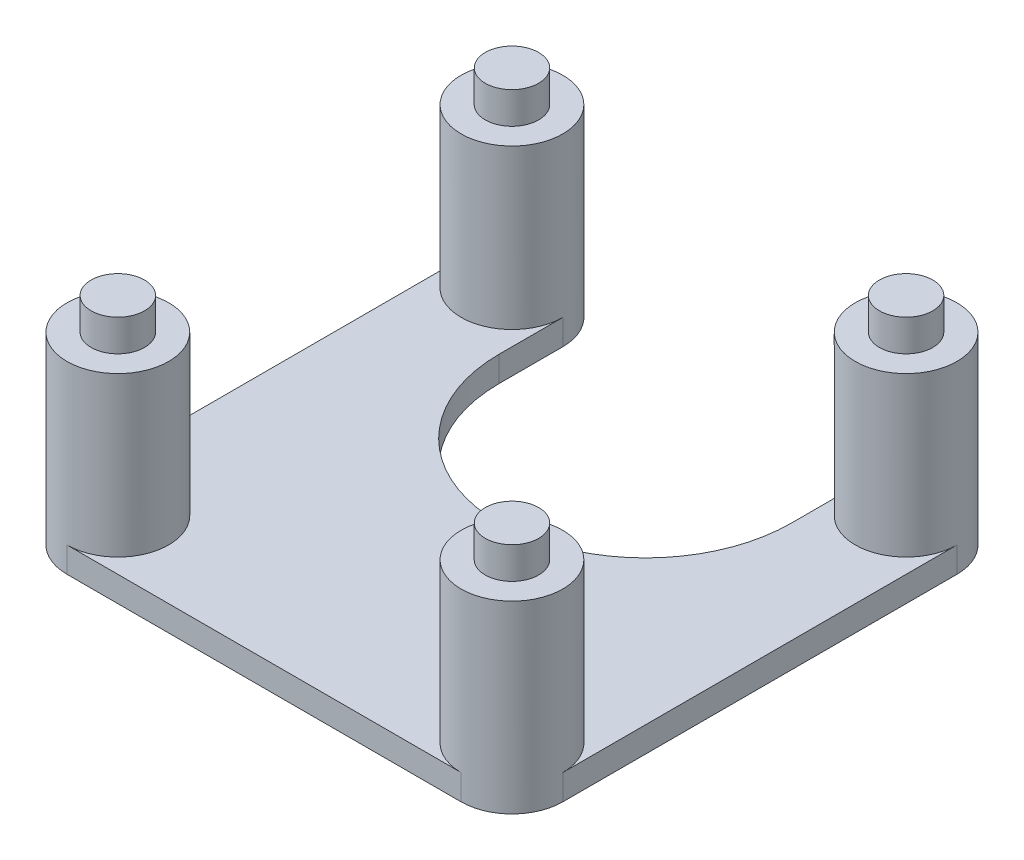
ISO-10303-21;
HEADER;
FILE_DESCRIPTION(('STEP AP214'),'2;1');
FILE_NAME('part.step','',(''),(''),'','','');
FILE_SCHEMA(('AUTOMOTIVE_DESIGN { 1 0 10303 214 1 1 1 1 }'));
ENDSEC;
DATA;
#1=APPLICATION_CONTEXT('core data for automotive mechanical design processes');
#2=APPLICATION_PROTOCOL_DEFINITION('international standard','automotive_design',2000,#1);
#3=PRODUCT_CONTEXT('',#1,'mechanical');
#4=PRODUCT('Part','Part','',(#3));
#5=PRODUCT_RELATED_PRODUCT_CATEGORY('part','',(#4));
#6=PRODUCT_DEFINITION_FORMATION('','',#4);
#7=PRODUCT_DEFINITION_CONTEXT('part definition',#1,'design');
#8=PRODUCT_DEFINITION('design','',#6,#7);
#9=PRODUCT_DEFINITION_SHAPE('','',#8);
#10=(LENGTH_UNIT() NAMED_UNIT(*) SI_UNIT(.MILLI.,.METRE.));
#11=(NAMED_UNIT(*) PLANE_ANGLE_UNIT() SI_UNIT($,.RADIAN.));
#12=(NAMED_UNIT(*) SI_UNIT($,.STERADIAN.) SOLID_ANGLE_UNIT());
#13=UNCERTAINTY_MEASURE_WITH_UNIT(LENGTH_MEASURE(1.E-05),#10,'distance_accuracy_value','');
#14=(GEOMETRIC_REPRESENTATION_CONTEXT(3) GLOBAL_UNCERTAINTY_ASSIGNED_CONTEXT((#13)) GLOBAL_UNIT_ASSIGNED_CONTEXT((#10,
#11,#12)) REPRESENTATION_CONTEXT('',''));
#15=CARTESIAN_POINT('',(0.,0.,0.));
#16=DIRECTION('',(0.,0.,1.));
#17=DIRECTION('',(1.,0.,0.));
#18=AXIS2_PLACEMENT_3D('',#15,#16,#17);
#19=CARTESIAN_POINT('',(0.,0.,0.));
#20=DIRECTION('',(0.,-1.,0.));
#21=DIRECTION('',(0.,0.,-1.));
#22=AXIS2_PLACEMENT_3D('',#19,#20,#21);
#23=PLANE('',#22);
#24=DIRECTION('',(0.,0.,1.));
#25=VECTOR('',#24,1.);
#26=CARTESIAN_POINT('',(19.5,0.,0.));
#27=LINE('',#26,#25);
#28=CARTESIAN_POINT('',(19.5,0.,-15.5));
#29=VERTEX_POINT('',#28);
#30=CARTESIAN_POINT('',(19.5,0.,15.5));
#31=VERTEX_POINT('',#30);
#32=EDGE_CURVE('E150',#29,#31,#27,.T.);
#33=ORIENTED_EDGE('',*,*,#32,.F.);
#34=CARTESIAN_POINT('',(15.5,0.,-15.5));
#35=DIRECTION('',(0.,1.,0.));
#36=DIRECTION('',(0.,0.,1.));
#37=AXIS2_PLACEMENT_3D('',#34,#35,#36);
#38=CIRCLE('',#37,4.00000000000001);
#39=CARTESIAN_POINT('',(11.5,0.,-15.5));
#40=VERTEX_POINT('',#39);
#41=EDGE_CURVE('E289',#29,#40,#38,.F.);
#42=ORIENTED_EDGE('',*,*,#41,.T.);
#43=DIRECTION('',(0.,0.,1.));
#44=VECTOR('',#43,1.);
#45=CARTESIAN_POINT('',(11.5,0.,0.));
#46=LINE('',#45,#44);
#47=CARTESIAN_POINT('',(11.5,0.,-10.4965458354431));
#48=VERTEX_POINT('',#47);
#49=EDGE_CURVE('E147',#40,#48,#46,.T.);
#50=ORIENTED_EDGE('',*,*,#49,.T.);
#51=CARTESIAN_POINT('',(0.,0.,-10.4965458354431));
#52=DIRECTION('',(0.,-1.,0.));
#53=DIRECTION('',(0.,0.,-1.));
#54=AXIS2_PLACEMENT_3D('',#51,#52,#53);
#55=CIRCLE('',#54,11.5);
#56=CARTESIAN_POINT('',(-11.5,0.,-10.4965458354431));
#57=VERTEX_POINT('',#56);
#58=EDGE_CURVE('E143',#57,#48,#55,.F.);
#59=ORIENTED_EDGE('',*,*,#58,.F.);
#60=DIRECTION('',(0.,0.,1.));
#61=VECTOR('',#60,1.);
#62=CARTESIAN_POINT('',(-11.5,0.,0.));
#63=LINE('',#62,#61);
#64=CARTESIAN_POINT('',(-11.5,0.,-15.5));
#65=VERTEX_POINT('',#64);
#66=EDGE_CURVE('E141',#65,#57,#63,.T.);
#67=ORIENTED_EDGE('',*,*,#66,.F.);
#68=CARTESIAN_POINT('',(-15.5,0.,-15.5));
#69=DIRECTION('',(0.,1.,0.));
#70=DIRECTION('',(0.,0.,1.));
#71=AXIS2_PLACEMENT_3D('',#68,#69,#70);
#72=CIRCLE('',#71,4.);
#73=CARTESIAN_POINT('',(-19.5,0.,-15.5));
#74=VERTEX_POINT('',#73);
#75=EDGE_CURVE('E245',#74,#65,#72,.T.);
#76=ORIENTED_EDGE('',*,*,#75,.F.);
#77=DIRECTION('',(0.,0.,1.));
#78=VECTOR('',#77,1.);
#79=CARTESIAN_POINT('',(-19.5,0.,0.));
#80=LINE('',#79,#78);
#81=CARTESIAN_POINT('',(-19.5,0.,15.5));
#82=VERTEX_POINT('',#81);
#83=EDGE_CURVE('E154',#74,#82,#80,.T.);
#84=ORIENTED_EDGE('',*,*,#83,.T.);
#85=CARTESIAN_POINT('',(-15.5,0.,15.5));
#86=DIRECTION('',(0.,1.,0.));
#87=DIRECTION('',(0.,0.,1.));
#88=AXIS2_PLACEMENT_3D('',#85,#86,#87);
#89=CIRCLE('',#88,4.);
#90=CARTESIAN_POINT('',(-15.5,0.,19.5));
#91=VERTEX_POINT('',#90);
#92=EDGE_CURVE('E39',#82,#91,#89,.F.);
#93=ORIENTED_EDGE('',*,*,#92,.T.);
#94=DIRECTION('',(1.,0.,0.));
#95=VECTOR('',#94,1.);
#96=CARTESIAN_POINT('',(0.,0.,19.5));
#97=LINE('',#96,#95);
#98=CARTESIAN_POINT('',(15.5,0.,19.5));
#99=VERTEX_POINT('',#98);
#100=EDGE_CURVE('E122',#91,#99,#97,.T.);
#101=ORIENTED_EDGE('',*,*,#100,.T.);
#102=CARTESIAN_POINT('',(15.5,0.,15.5));
#103=DIRECTION('',(0.,1.,0.));
#104=DIRECTION('',(0.,0.,1.));
#105=AXIS2_PLACEMENT_3D('',#102,#103,#104);
#106=CIRCLE('',#105,4.);
#107=EDGE_CURVE('E269',#31,#99,#106,.T.);
#108=ORIENTED_EDGE('',*,*,#107,.F.);
#109=EDGE_LOOP('',(#33,#42,#50,#59,#67,#76,#84,#93,#101,#108));
#110=FACE_BOUND('',#109,.T.);
#111=ADVANCED_FACE('F35',(#110),#23,.F.);
#112=CARTESIAN_POINT('',(-15.5,12.5,15.5));
#113=DIRECTION('',(0.,-1.,0.));
#114=DIRECTION('',(0.,0.,-1.));
#115=AXIS2_PLACEMENT_3D('',#112,#113,#114);
#116=CYLINDRICAL_SURFACE('',#115,4.);
#117=CARTESIAN_POINT('',(-15.5,12.5,15.5));
#118=DIRECTION('',(0.,1.,0.));
#119=DIRECTION('',(0.,0.,1.));
#120=AXIS2_PLACEMENT_3D('',#117,#118,#119);
#121=CIRCLE('',#120,4.);
#122=CARTESIAN_POINT('',(-15.5,12.5,19.5));
#123=VERTEX_POINT('',#122);
#124=EDGE_CURVE('E11',#123,#123,#121,.F.);
#125=ORIENTED_EDGE('',*,*,#124,.T.);
#126=EDGE_LOOP('',(#125));
#127=FACE_BOUND('',#126,.T.);
#128=ORIENTED_EDGE('',*,*,#92,.F.);
#129=DIRECTION('',(0.,1.,0.));
#130=VECTOR('',#129,1.);
#131=CARTESIAN_POINT('',(-19.5,-2.,15.5));
#132=LINE('',#131,#130);
#133=CARTESIAN_POINT('',(-19.5,-2.,15.5));
#134=VERTEX_POINT('',#133);
#135=EDGE_CURVE('E124',#134,#82,#132,.T.);
#136=ORIENTED_EDGE('',*,*,#135,.F.);
#137=CARTESIAN_POINT('',(-15.5,-2.,15.5));
#138=DIRECTION('',(0.,-1.,0.));
#139=DIRECTION('',(0.,0.,-1.));
#140=AXIS2_PLACEMENT_3D('',#137,#138,#139);
#141=CIRCLE('',#140,4.);
#142=CARTESIAN_POINT('',(-15.5,-2.,19.5));
#143=VERTEX_POINT('',#142);
#144=EDGE_CURVE('E126',#143,#134,#141,.T.);
#145=ORIENTED_EDGE('',*,*,#144,.F.);
#146=DIRECTION('',(0.,1.,0.));
#147=VECTOR('',#146,1.);
#148=CARTESIAN_POINT('',(-15.5,-2.,19.5));
#149=LINE('',#148,#147);
#150=EDGE_CURVE('E116',#143,#91,#149,.T.);
#151=ORIENTED_EDGE('',*,*,#150,.T.);
#152=EDGE_LOOP('',(#128,#136,#145,#151));
#153=FACE_BOUND('',#152,.T.);
#154=ADVANCED_FACE('F37',(#127,#153),#116,.T.);
#155=CARTESIAN_POINT('',(0.,12.5,0.));
#156=DIRECTION('',(0.,1.,0.));
#157=DIRECTION('',(0.,0.,1.));
#158=AXIS2_PLACEMENT_3D('',#155,#156,#157);
#159=PLANE('',#158);
#160=CARTESIAN_POINT('',(-15.5,12.5,15.5));
#161=DIRECTION('',(0.,1.,0.));
#162=DIRECTION('',(0.,0.,1.));
#163=AXIS2_PLACEMENT_3D('',#160,#161,#162);
#164=CIRCLE('',#163,2.1);
#165=CARTESIAN_POINT('',(-15.5,12.5,17.6));
#166=VERTEX_POINT('',#165);
#167=EDGE_CURVE('E176',#166,#166,#164,.F.);
#168=ORIENTED_EDGE('',*,*,#167,.T.);
#169=EDGE_LOOP('',(#168));
#170=FACE_BOUND('',#169,.T.);
#171=ORIENTED_EDGE('',*,*,#124,.F.);
#172=EDGE_LOOP('',(#171));
#173=FACE_BOUND('',#172,.T.);
#174=ADVANCED_FACE('F183',(#170,#173),#159,.T.);
#175=CARTESIAN_POINT('',(-15.5,15.,15.5));
#176=DIRECTION('',(0.,-1.,0.));
#177=DIRECTION('',(0.,0.,-1.));
#178=AXIS2_PLACEMENT_3D('',#175,#176,#177);
#179=CYLINDRICAL_SURFACE('',#178,2.1);
#180=CARTESIAN_POINT('',(-15.5,15.,15.5));
#181=DIRECTION('',(0.,1.,0.));
#182=DIRECTION('',(0.,0.,1.));
#183=AXIS2_PLACEMENT_3D('',#180,#181,#182);
#184=CIRCLE('',#183,2.1);
#185=CARTESIAN_POINT('',(-15.5,15.,17.6));
#186=VERTEX_POINT('',#185);
#187=EDGE_CURVE('E177',#186,#186,#184,.F.);
#188=ORIENTED_EDGE('',*,*,#187,.T.);
#189=EDGE_LOOP('',(#188));
#190=FACE_BOUND('',#189,.T.);
#191=ORIENTED_EDGE('',*,*,#167,.F.);
#192=EDGE_LOOP('',(#191));
#193=FACE_BOUND('',#192,.T.);
#194=ADVANCED_FACE('F186',(#190,#193),#179,.T.);
#195=CARTESIAN_POINT('',(0.,15.,0.));
#196=DIRECTION('',(0.,1.,0.));
#197=DIRECTION('',(0.,0.,1.));
#198=AXIS2_PLACEMENT_3D('',#195,#196,#197);
#199=PLANE('',#198);
#200=ORIENTED_EDGE('',*,*,#187,.F.);
#201=EDGE_LOOP('',(#200));
#202=FACE_BOUND('',#201,.T.);
#203=ADVANCED_FACE('F188',(#202),#199,.T.);
#204=CARTESIAN_POINT('',(-15.5,-2.,-15.5));
#205=DIRECTION('',(0.,1.,0.));
#206=DIRECTION('',(0.,0.,1.));
#207=AXIS2_PLACEMENT_3D('',#204,#205,#206);
#208=CYLINDRICAL_SURFACE('',#207,4.);
#209=DIRECTION('',(0.,1.,0.));
#210=VECTOR('',#209,1.);
#211=CARTESIAN_POINT('',(-19.5,-2.,-15.5));
#212=LINE('',#211,#210);
#213=CARTESIAN_POINT('',(-19.5,-2.,-15.5));
#214=VERTEX_POINT('',#213);
#215=EDGE_CURVE('E58',#214,#74,#212,.T.);
#216=ORIENTED_EDGE('',*,*,#215,.T.);
#217=ORIENTED_EDGE('',*,*,#75,.T.);
#218=DIRECTION('',(0.,1.,0.));
#219=VECTOR('',#218,1.);
#220=CARTESIAN_POINT('',(-11.5,-2.,-15.5));
#221=LINE('',#220,#219);
#222=CARTESIAN_POINT('',(-11.5,-2.,-15.5));
#223=VERTEX_POINT('',#222);
#224=EDGE_CURVE('E174',#223,#65,#221,.T.);
#225=ORIENTED_EDGE('',*,*,#224,.F.);
#226=CARTESIAN_POINT('',(-15.5,-2.,-15.5));
#227=DIRECTION('',(0.,-1.,0.));
#228=DIRECTION('',(0.,0.,-1.));
#229=AXIS2_PLACEMENT_3D('',#226,#227,#228);
#230=CIRCLE('',#229,4.);
#231=EDGE_CURVE('E156',#214,#223,#230,.T.);
#232=ORIENTED_EDGE('',*,*,#231,.F.);
#233=EDGE_LOOP('',(#216,#217,#225,#232));
#234=FACE_BOUND('',#233,.T.);
#235=CARTESIAN_POINT('',(-15.5,12.5,-15.5));
#236=DIRECTION('',(0.,1.,0.));
#237=DIRECTION('',(0.,0.,1.));
#238=AXIS2_PLACEMENT_3D('',#235,#236,#237);
#239=CIRCLE('',#238,4.);
#240=CARTESIAN_POINT('',(-15.5,12.5,-11.5));
#241=VERTEX_POINT('',#240);
#242=EDGE_CURVE('E243',#241,#241,#239,.T.);
#243=ORIENTED_EDGE('',*,*,#242,.F.);
#244=EDGE_LOOP('',(#243));
#245=FACE_BOUND('',#244,.T.);
#246=ADVANCED_FACE('F195',(#234,#245),#208,.T.);
#247=CARTESIAN_POINT('',(-11.5,-2.,0.));
#248=DIRECTION('',(-1.,0.,0.));
#249=DIRECTION('',(0.,0.,1.));
#250=AXIS2_PLACEMENT_3D('',#247,#248,#249);
#251=PLANE('',#250);
#252=ORIENTED_EDGE('',*,*,#66,.T.);
#253=DIRECTION('',(0.,1.,0.));
#254=VECTOR('',#253,1.);
#255=CARTESIAN_POINT('',(-11.5,-2.,-10.4965458354431));
#256=LINE('',#255,#254);
#257=CARTESIAN_POINT('',(-11.5,-2.,-10.4965458354431));
#258=VERTEX_POINT('',#257);
#259=EDGE_CURVE('E171',#258,#57,#256,.T.);
#260=ORIENTED_EDGE('',*,*,#259,.F.);
#261=DIRECTION('',(0.,0.,1.));
#262=VECTOR('',#261,1.);
#263=CARTESIAN_POINT('',(-11.5,-2.,0.));
#264=LINE('',#263,#262);
#265=EDGE_CURVE('E92',#223,#258,#264,.T.);
#266=ORIENTED_EDGE('',*,*,#265,.F.);
#267=ORIENTED_EDGE('',*,*,#224,.T.);
#268=EDGE_LOOP('',(#252,#260,#266,#267));
#269=FACE_BOUND('',#268,.T.);
#270=ADVANCED_FACE('F232',(#269),#251,.F.);
#271=CARTESIAN_POINT('',(0.,-2.,-10.4965458354431));
#272=DIRECTION('',(0.,1.,0.));
#273=DIRECTION('',(0.,0.,1.));
#274=AXIS2_PLACEMENT_3D('',#271,#272,#273);
#275=CYLINDRICAL_SURFACE('',#274,11.5);
#276=ORIENTED_EDGE('',*,*,#58,.T.);
#277=DIRECTION('',(0.,1.,0.));
#278=VECTOR('',#277,1.);
#279=CARTESIAN_POINT('',(11.5,-2.,-10.4965458354431));
#280=LINE('',#279,#278);
#281=CARTESIAN_POINT('',(11.5,-2.,-10.4965458354431));
#282=VERTEX_POINT('',#281);
#283=EDGE_CURVE('E169',#282,#48,#280,.T.);
#284=ORIENTED_EDGE('',*,*,#283,.F.);
#285=CARTESIAN_POINT('',(0.,-2.,-10.4965458354431));
#286=DIRECTION('',(0.,-1.,0.));
#287=DIRECTION('',(0.,0.,-1.));
#288=AXIS2_PLACEMENT_3D('',#285,#286,#287);
#289=CIRCLE('',#288,11.5);
#290=EDGE_CURVE('E255',#258,#282,#289,.F.);
#291=ORIENTED_EDGE('',*,*,#290,.F.);
#292=ORIENTED_EDGE('',*,*,#259,.T.);
#293=EDGE_LOOP('',(#276,#284,#291,#292));
#294=FACE_BOUND('',#293,.T.);
#295=ADVANCED_FACE('F228',(#294),#275,.F.);
#296=CARTESIAN_POINT('',(11.5,-2.,0.));
#297=DIRECTION('',(-1.,0.,0.));
#298=DIRECTION('',(0.,0.,1.));
#299=AXIS2_PLACEMENT_3D('',#296,#297,#298);
#300=PLANE('',#299);
#301=ORIENTED_EDGE('',*,*,#49,.F.);
#302=DIRECTION('',(0.,1.,0.));
#303=VECTOR('',#302,1.);
#304=CARTESIAN_POINT('',(11.5,-2.,-15.5));
#305=LINE('',#304,#303);
#306=CARTESIAN_POINT('',(11.5,-2.,-15.5));
#307=VERTEX_POINT('',#306);
#308=EDGE_CURVE('E166',#307,#40,#305,.T.);
#309=ORIENTED_EDGE('',*,*,#308,.F.);
#310=DIRECTION('',(0.,0.,1.));
#311=VECTOR('',#310,1.);
#312=CARTESIAN_POINT('',(11.5,-2.,0.));
#313=LINE('',#312,#311);
#314=EDGE_CURVE('E257',#307,#282,#313,.T.);
#315=ORIENTED_EDGE('',*,*,#314,.T.);
#316=ORIENTED_EDGE('',*,*,#283,.T.);
#317=EDGE_LOOP('',(#301,#309,#315,#316));
#318=FACE_BOUND('',#317,.T.);
#319=ADVANCED_FACE('F224',(#318),#300,.T.);
#320=CARTESIAN_POINT('',(15.5,-2.,-15.5));
#321=DIRECTION('',(0.,1.,0.));
#322=DIRECTION('',(0.,0.,1.));
#323=AXIS2_PLACEMENT_3D('',#320,#321,#322);
#324=CYLINDRICAL_SURFACE('',#323,4.);
#325=ORIENTED_EDGE('',*,*,#308,.T.);
#326=ORIENTED_EDGE('',*,*,#41,.F.);
#327=DIRECTION('',(0.,1.,0.));
#328=VECTOR('',#327,1.);
#329=CARTESIAN_POINT('',(19.5,-2.,-15.5));
#330=LINE('',#329,#328);
#331=CARTESIAN_POINT('',(19.5,-2.,-15.5));
#332=VERTEX_POINT('',#331);
#333=EDGE_CURVE('E163',#332,#29,#330,.T.);
#334=ORIENTED_EDGE('',*,*,#333,.F.);
#335=CARTESIAN_POINT('',(15.5,-2.,-15.5));
#336=DIRECTION('',(0.,-1.,0.));
#337=DIRECTION('',(0.,0.,-1.));
#338=AXIS2_PLACEMENT_3D('',#335,#336,#337);
#339=CIRCLE('',#338,4.);
#340=EDGE_CURVE('E260',#307,#332,#339,.T.);
#341=ORIENTED_EDGE('',*,*,#340,.F.);
#342=EDGE_LOOP('',(#325,#326,#334,#341));
#343=FACE_BOUND('',#342,.T.);
#344=CARTESIAN_POINT('',(15.5,12.5,-15.5));
#345=DIRECTION('',(0.,1.,0.));
#346=DIRECTION('',(0.,0.,1.));
#347=AXIS2_PLACEMENT_3D('',#344,#345,#346);
#348=CIRCLE('',#347,4.00000000000001);
#349=CARTESIAN_POINT('',(15.5,12.5,-11.5));
#350=VERTEX_POINT('',#349);
#351=EDGE_CURVE('E279',#350,#350,#348,.F.);
#352=ORIENTED_EDGE('',*,*,#351,.T.);
#353=EDGE_LOOP('',(#352));
#354=FACE_BOUND('',#353,.T.);
#355=ADVANCED_FACE('F220',(#343,#354),#324,.T.);
#356=CARTESIAN_POINT('',(19.5,-2.,0.));
#357=DIRECTION('',(-1.,0.,0.));
#358=DIRECTION('',(0.,0.,1.));
#359=AXIS2_PLACEMENT_3D('',#356,#357,#358);
#360=PLANE('',#359);
#361=ORIENTED_EDGE('',*,*,#32,.T.);
#362=DIRECTION('',(0.,1.,0.));
#363=VECTOR('',#362,1.);
#364=CARTESIAN_POINT('',(19.5,-2.,15.5));
#365=LINE('',#364,#363);
#366=CARTESIAN_POINT('',(19.5,-2.,15.5));
#367=VERTEX_POINT('',#366);
#368=EDGE_CURVE('E160',#367,#31,#365,.T.);
#369=ORIENTED_EDGE('',*,*,#368,.F.);
#370=DIRECTION('',(0.,0.,1.));
#371=VECTOR('',#370,1.);
#372=CARTESIAN_POINT('',(19.5,-2.,0.));
#373=LINE('',#372,#371);
#374=EDGE_CURVE('E136',#332,#367,#373,.T.);
#375=ORIENTED_EDGE('',*,*,#374,.F.);
#376=ORIENTED_EDGE('',*,*,#333,.T.);
#377=EDGE_LOOP('',(#361,#369,#375,#376));
#378=FACE_BOUND('',#377,.T.);
#379=ADVANCED_FACE('F216',(#378),#360,.F.);
#380=CARTESIAN_POINT('',(15.5,-2.,15.5));
#381=DIRECTION('',(0.,1.,0.));
#382=DIRECTION('',(0.,0.,1.));
#383=AXIS2_PLACEMENT_3D('',#380,#381,#382);
#384=CYLINDRICAL_SURFACE('',#383,4.);
#385=ORIENTED_EDGE('',*,*,#368,.T.);
#386=ORIENTED_EDGE('',*,*,#107,.T.);
#387=DIRECTION('',(0.,1.,0.));
#388=VECTOR('',#387,1.);
#389=CARTESIAN_POINT('',(15.5,-2.,19.5));
#390=LINE('',#389,#388);
#391=CARTESIAN_POINT('',(15.5,-2.,19.5));
#392=VERTEX_POINT('',#391);
#393=EDGE_CURVE('E123',#392,#99,#390,.T.);
#394=ORIENTED_EDGE('',*,*,#393,.F.);
#395=CARTESIAN_POINT('',(15.5,-2.,15.5));
#396=DIRECTION('',(0.,-1.,0.));
#397=DIRECTION('',(0.,0.,-1.));
#398=AXIS2_PLACEMENT_3D('',#395,#396,#397);
#399=CIRCLE('',#398,4.);
#400=EDGE_CURVE('E133',#367,#392,#399,.T.);
#401=ORIENTED_EDGE('',*,*,#400,.F.);
#402=EDGE_LOOP('',(#385,#386,#394,#401));
#403=FACE_BOUND('',#402,.T.);
#404=CARTESIAN_POINT('',(15.5,12.5,15.5));
#405=DIRECTION('',(0.,1.,0.));
#406=DIRECTION('',(0.,0.,1.));
#407=AXIS2_PLACEMENT_3D('',#404,#405,#406);
#408=CIRCLE('',#407,4.);
#409=CARTESIAN_POINT('',(15.5,12.5,19.5));
#410=VERTEX_POINT('',#409);
#411=EDGE_CURVE('E272',#410,#410,#408,.T.);
#412=ORIENTED_EDGE('',*,*,#411,.F.);
#413=EDGE_LOOP('',(#412));
#414=FACE_BOUND('',#413,.T.);
#415=ADVANCED_FACE('F213',(#403,#414),#384,.T.);
#416=CARTESIAN_POINT('',(0.,-2.,19.5));
#417=DIRECTION('',(0.,0.,1.));
#418=DIRECTION('',(1.,0.,0.));
#419=AXIS2_PLACEMENT_3D('',#416,#417,#418);
#420=PLANE('',#419);
#421=ORIENTED_EDGE('',*,*,#100,.F.);
#422=ORIENTED_EDGE('',*,*,#150,.F.);
#423=DIRECTION('',(1.,0.,0.));
#424=VECTOR('',#423,1.);
#425=CARTESIAN_POINT('',(0.,-2.,19.5));
#426=LINE('',#425,#424);
#427=EDGE_CURVE('E121',#143,#392,#426,.T.);
#428=ORIENTED_EDGE('',*,*,#427,.T.);
#429=ORIENTED_EDGE('',*,*,#393,.T.);
#430=EDGE_LOOP('',(#421,#422,#428,#429));
#431=FACE_BOUND('',#430,.T.);
#432=ADVANCED_FACE('F118',(#431),#420,.T.);
#433=CARTESIAN_POINT('',(-19.5,-2.,0.));
#434=DIRECTION('',(-1.,0.,0.));
#435=DIRECTION('',(0.,0.,1.));
#436=AXIS2_PLACEMENT_3D('',#433,#434,#435);
#437=PLANE('',#436);
#438=ORIENTED_EDGE('',*,*,#83,.F.);
#439=ORIENTED_EDGE('',*,*,#215,.F.);
#440=DIRECTION('',(0.,0.,1.));
#441=VECTOR('',#440,1.);
#442=CARTESIAN_POINT('',(-19.5,-2.,0.));
#443=LINE('',#442,#441);
#444=EDGE_CURVE('E129',#214,#134,#443,.T.);
#445=ORIENTED_EDGE('',*,*,#444,.T.);
#446=ORIENTED_EDGE('',*,*,#135,.T.);
#447=EDGE_LOOP('',(#438,#439,#445,#446));
#448=FACE_BOUND('',#447,.T.);
#449=ADVANCED_FACE('F208',(#448),#437,.T.);
#450=CARTESIAN_POINT('',(0.,-2.,0.));
#451=DIRECTION('',(0.,-1.,0.));
#452=DIRECTION('',(0.,0.,-1.));
#453=AXIS2_PLACEMENT_3D('',#450,#451,#452);
#454=PLANE('',#453);
#455=ORIENTED_EDGE('',*,*,#231,.T.);
#456=ORIENTED_EDGE('',*,*,#265,.T.);
#457=ORIENTED_EDGE('',*,*,#290,.T.);
#458=ORIENTED_EDGE('',*,*,#314,.F.);
#459=ORIENTED_EDGE('',*,*,#340,.T.);
#460=ORIENTED_EDGE('',*,*,#374,.T.);
#461=ORIENTED_EDGE('',*,*,#400,.T.);
#462=ORIENTED_EDGE('',*,*,#427,.F.);
#463=ORIENTED_EDGE('',*,*,#144,.T.);
#464=ORIENTED_EDGE('',*,*,#444,.F.);
#465=EDGE_LOOP('',(#455,#456,#457,#458,#459,#460,#461,#462,#463,#464));
#466=FACE_BOUND('',#465,.T.);
#467=ADVANCED_FACE('F131',(#466),#454,.T.);
#468=CARTESIAN_POINT('',(0.,12.5,0.));
#469=DIRECTION('',(0.,1.,0.));
#470=DIRECTION('',(0.,0.,1.));
#471=AXIS2_PLACEMENT_3D('',#468,#469,#470);
#472=PLANE('',#471);
#473=CARTESIAN_POINT('',(-15.5,12.5,-15.5));
#474=DIRECTION('',(0.,1.,0.));
#475=DIRECTION('',(0.,0.,1.));
#476=AXIS2_PLACEMENT_3D('',#473,#474,#475);
#477=CIRCLE('',#476,2.1);
#478=CARTESIAN_POINT('',(-15.5,12.5,-13.4));
#479=VERTEX_POINT('',#478);
#480=EDGE_CURVE('E144',#479,#479,#477,.T.);
#481=ORIENTED_EDGE('',*,*,#480,.F.);
#482=EDGE_LOOP('',(#481));
#483=FACE_BOUND('',#482,.T.);
#484=ORIENTED_EDGE('',*,*,#242,.T.);
#485=EDGE_LOOP('',(#484));
#486=FACE_BOUND('',#485,.T.);
#487=ADVANCED_FACE('F332',(#483,#486),#472,.T.);
#488=CARTESIAN_POINT('',(-15.5,15.,-15.5));
#489=DIRECTION('',(0.,-1.,0.));
#490=DIRECTION('',(0.,0.,-1.));
#491=AXIS2_PLACEMENT_3D('',#488,#489,#490);
#492=CYLINDRICAL_SURFACE('',#491,2.1);
#493=CARTESIAN_POINT('',(-15.5,15.,-15.5));
#494=DIRECTION('',(0.,1.,0.));
#495=DIRECTION('',(0.,0.,1.));
#496=AXIS2_PLACEMENT_3D('',#493,#494,#495);
#497=CIRCLE('',#496,2.1);
#498=CARTESIAN_POINT('',(-15.5,15.,-13.4));
#499=VERTEX_POINT('',#498);
#500=EDGE_CURVE('E249',#499,#499,#497,.T.);
#501=ORIENTED_EDGE('',*,*,#500,.F.);
#502=EDGE_LOOP('',(#501));
#503=FACE_BOUND('',#502,.T.);
#504=ORIENTED_EDGE('',*,*,#480,.T.);
#505=EDGE_LOOP('',(#504));
#506=FACE_BOUND('',#505,.T.);
#507=ADVANCED_FACE('F330',(#503,#506),#492,.T.);
#508=CARTESIAN_POINT('',(0.,15.,0.));
#509=DIRECTION('',(0.,1.,0.));
#510=DIRECTION('',(0.,0.,1.));
#511=AXIS2_PLACEMENT_3D('',#508,#509,#510);
#512=PLANE('',#511);
#513=ORIENTED_EDGE('',*,*,#500,.T.);
#514=EDGE_LOOP('',(#513));
#515=FACE_BOUND('',#514,.T.);
#516=ADVANCED_FACE('F326',(#515),#512,.T.);
#517=CARTESIAN_POINT('',(0.,12.5,0.));
#518=DIRECTION('',(0.,1.,0.));
#519=DIRECTION('',(0.,0.,1.));
#520=AXIS2_PLACEMENT_3D('',#517,#518,#519);
#521=PLANE('',#520);
#522=CARTESIAN_POINT('',(15.5,12.5,15.5));
#523=DIRECTION('',(0.,1.,0.));
#524=DIRECTION('',(0.,0.,1.));
#525=AXIS2_PLACEMENT_3D('',#522,#523,#524);
#526=CIRCLE('',#525,2.1);
#527=CARTESIAN_POINT('',(15.5,12.5,17.6));
#528=VERTEX_POINT('',#527);
#529=EDGE_CURVE('E276',#528,#528,#526,.T.);
#530=ORIENTED_EDGE('',*,*,#529,.F.);
#531=EDGE_LOOP('',(#530));
#532=FACE_BOUND('',#531,.T.);
#533=ORIENTED_EDGE('',*,*,#411,.T.);
#534=EDGE_LOOP('',(#533));
#535=FACE_BOUND('',#534,.T.);
#536=ADVANCED_FACE('F322',(#532,#535),#521,.T.);
#537=CARTESIAN_POINT('',(15.5,15.,15.5));
#538=DIRECTION('',(0.,-1.,0.));
#539=DIRECTION('',(0.,0.,-1.));
#540=AXIS2_PLACEMENT_3D('',#537,#538,#539);
#541=CYLINDRICAL_SURFACE('',#540,2.1);
#542=CARTESIAN_POINT('',(15.5,15.,15.5));
#543=DIRECTION('',(0.,1.,0.));
#544=DIRECTION('',(0.,0.,1.));
#545=AXIS2_PLACEMENT_3D('',#542,#543,#544);
#546=CIRCLE('',#545,2.1);
#547=CARTESIAN_POINT('',(15.5,15.,17.6));
#548=VERTEX_POINT('',#547);
#549=EDGE_CURVE('E273',#548,#548,#546,.T.);
#550=ORIENTED_EDGE('',*,*,#549,.F.);
#551=EDGE_LOOP('',(#550));
#552=FACE_BOUND('',#551,.T.);
#553=ORIENTED_EDGE('',*,*,#529,.T.);
#554=EDGE_LOOP('',(#553));
#555=FACE_BOUND('',#554,.T.);
#556=ADVANCED_FACE('F318',(#552,#555),#541,.T.);
#557=CARTESIAN_POINT('',(0.,15.,0.));
#558=DIRECTION('',(0.,1.,0.));
#559=DIRECTION('',(0.,0.,1.));
#560=AXIS2_PLACEMENT_3D('',#557,#558,#559);
#561=PLANE('',#560);
#562=ORIENTED_EDGE('',*,*,#549,.T.);
#563=EDGE_LOOP('',(#562));
#564=FACE_BOUND('',#563,.T.);
#565=ADVANCED_FACE('F314',(#564),#561,.T.);
#566=CARTESIAN_POINT('',(0.,12.5,0.));
#567=DIRECTION('',(0.,1.,0.));
#568=DIRECTION('',(0.,0.,1.));
#569=AXIS2_PLACEMENT_3D('',#566,#567,#568);
#570=PLANE('',#569);
#571=CARTESIAN_POINT('',(15.5,12.5,-15.5));
#572=DIRECTION('',(0.,1.,0.));
#573=DIRECTION('',(0.,0.,1.));
#574=AXIS2_PLACEMENT_3D('',#571,#572,#573);
#575=CIRCLE('',#574,2.1);
#576=CARTESIAN_POINT('',(15.5,12.5,-13.4));
#577=VERTEX_POINT('',#576);
#578=EDGE_CURVE('E294',#577,#577,#575,.F.);
#579=ORIENTED_EDGE('',*,*,#578,.T.);
#580=EDGE_LOOP('',(#579));
#581=FACE_BOUND('',#580,.T.);
#582=ORIENTED_EDGE('',*,*,#351,.F.);
#583=EDGE_LOOP('',(#582));
#584=FACE_BOUND('',#583,.T.);
#585=ADVANCED_FACE('F309',(#581,#584),#570,.T.);
#586=CARTESIAN_POINT('',(15.5,15.,-15.5));
#587=DIRECTION('',(0.,-1.,0.));
#588=DIRECTION('',(0.,0.,-1.));
#589=AXIS2_PLACEMENT_3D('',#586,#587,#588);
#590=CYLINDRICAL_SURFACE('',#589,2.1);
#591=CARTESIAN_POINT('',(15.5,15.,-15.5));
#592=DIRECTION('',(0.,1.,0.));
#593=DIRECTION('',(0.,0.,1.));
#594=AXIS2_PLACEMENT_3D('',#591,#592,#593);
#595=CIRCLE('',#594,2.1);
#596=CARTESIAN_POINT('',(15.5,15.,-13.4));
#597=VERTEX_POINT('',#596);
#598=EDGE_CURVE('E291',#597,#597,#595,.F.);
#599=ORIENTED_EDGE('',*,*,#598,.T.);
#600=EDGE_LOOP('',(#599));
#601=FACE_BOUND('',#600,.T.);
#602=ORIENTED_EDGE('',*,*,#578,.F.);
#603=EDGE_LOOP('',(#602));
#604=FACE_BOUND('',#603,.T.);
#605=ADVANCED_FACE('F300',(#601,#604),#590,.T.);
#606=CARTESIAN_POINT('',(0.,15.,0.));
#607=DIRECTION('',(0.,1.,0.));
#608=DIRECTION('',(0.,0.,1.));
#609=AXIS2_PLACEMENT_3D('',#606,#607,#608);
#610=PLANE('',#609);
#611=ORIENTED_EDGE('',*,*,#598,.F.);
#612=EDGE_LOOP('',(#611));
#613=FACE_BOUND('',#612,.T.);
#614=ADVANCED_FACE('F303',(#613),#610,.T.);
#615=CLOSED_SHELL('',(#111,#154,#174,#194,#203,#246,#270,#295,#319,#355,#379,#415,#432,#449,
#467,#487,#507,#516,#536,#556,#565,#585,#605,#614));
#616=MANIFOLD_SOLID_BREP('B2',#615);
#617=ADVANCED_BREP_SHAPE_REPRESENTATION('',(#18,#616),#14);
#618=SHAPE_DEFINITION_REPRESENTATION(#9,#617);
ENDSEC;
END-ISO-10303-21;
